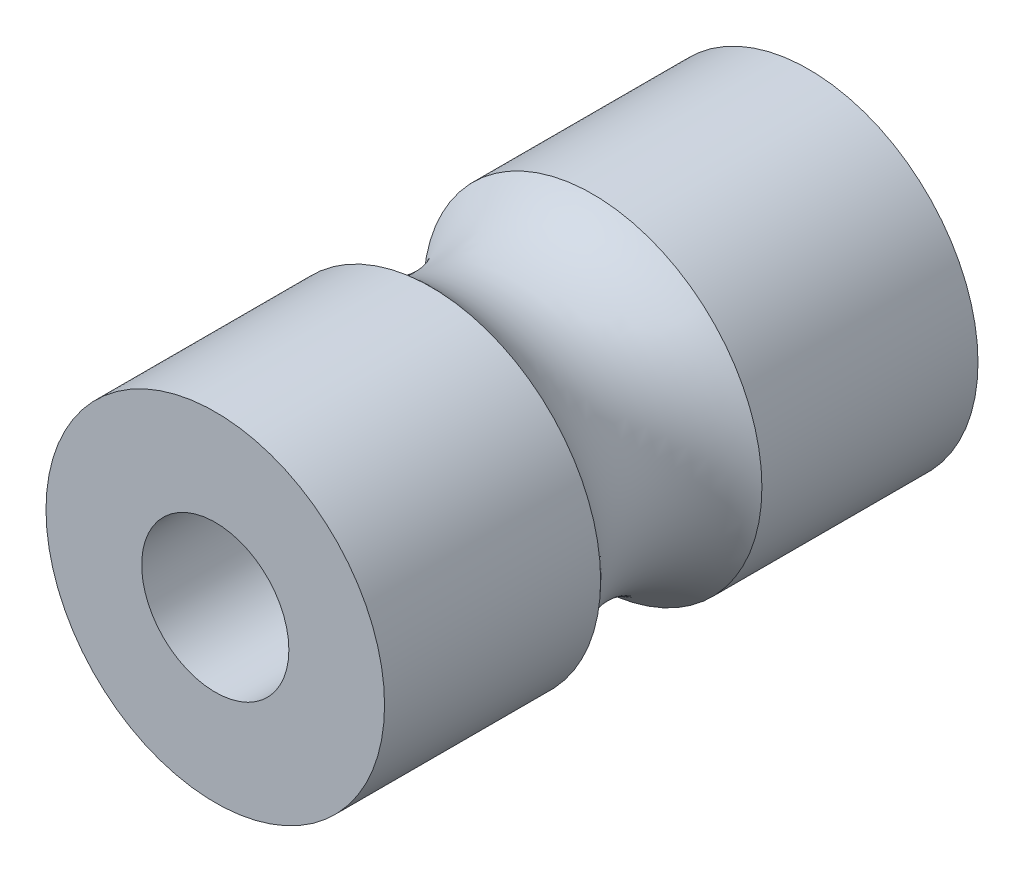
ISO-10303-21;
HEADER;
FILE_DESCRIPTION(('STEP AP214'),'2;1');
FILE_NAME('part.step','',(''),(''),'','','');
FILE_SCHEMA(('AUTOMOTIVE_DESIGN { 1 0 10303 214 1 1 1 1 }'));
ENDSEC;
DATA;
#1=APPLICATION_CONTEXT('core data for automotive mechanical design processes');
#2=APPLICATION_PROTOCOL_DEFINITION('international standard','automotive_design',2000,#1);
#3=PRODUCT_CONTEXT('',#1,'mechanical');
#4=PRODUCT('Part','Part','',(#3));
#5=PRODUCT_RELATED_PRODUCT_CATEGORY('part','',(#4));
#6=PRODUCT_DEFINITION_FORMATION('','',#4);
#7=PRODUCT_DEFINITION_CONTEXT('part definition',#1,'design');
#8=PRODUCT_DEFINITION('design','',#6,#7);
#9=PRODUCT_DEFINITION_SHAPE('','',#8);
#10=(LENGTH_UNIT() NAMED_UNIT(*) SI_UNIT(.MILLI.,.METRE.));
#11=(NAMED_UNIT(*) PLANE_ANGLE_UNIT() SI_UNIT($,.RADIAN.));
#12=(NAMED_UNIT(*) SI_UNIT($,.STERADIAN.) SOLID_ANGLE_UNIT());
#13=UNCERTAINTY_MEASURE_WITH_UNIT(LENGTH_MEASURE(1.E-05),#10,'distance_accuracy_value','');
#14=(GEOMETRIC_REPRESENTATION_CONTEXT(3) GLOBAL_UNCERTAINTY_ASSIGNED_CONTEXT((#13)) GLOBAL_UNIT_ASSIGNED_CONTEXT((#10,
#11,#12)) REPRESENTATION_CONTEXT('',''));
#15=CARTESIAN_POINT('',(0.,0.,0.));
#16=DIRECTION('',(0.,0.,1.));
#17=DIRECTION('',(1.,0.,0.));
#18=AXIS2_PLACEMENT_3D('',#15,#16,#17);
#19=CARTESIAN_POINT('',(0.,0.,-16.));
#20=DIRECTION('',(0.,0.,1.));
#21=DIRECTION('',(1.,0.,0.));
#22=AXIS2_PLACEMENT_3D('',#19,#20,#21);
#23=CYLINDRICAL_SURFACE('',#22,9.128125);
#24=CARTESIAN_POINT('',(0.,0.,16.));
#25=DIRECTION('',(0.,0.,1.));
#26=DIRECTION('',(1.,0.,0.));
#27=AXIS2_PLACEMENT_3D('',#24,#25,#26);
#28=CIRCLE('',#27,9.128125);
#29=CARTESIAN_POINT('',(9.128125,0.,16.));
#30=VERTEX_POINT('',#29);
#31=EDGE_CURVE('E45',#30,#30,#28,.T.);
#32=ORIENTED_EDGE('',*,*,#31,.F.);
#33=EDGE_LOOP('',(#32));
#34=FACE_BOUND('',#33,.T.);
#35=CARTESIAN_POINT('',(0.,0.,4.34821151272279));
#36=DIRECTION('',(0.,0.,-1.));
#37=DIRECTION('',(-1.,0.,0.));
#38=AXIS2_PLACEMENT_3D('',#35,#36,#37);
#39=CIRCLE('',#38,9.128125);
#40=CARTESIAN_POINT('',(-9.128125,0.,4.34821151272279));
#41=VERTEX_POINT('',#40);
#42=EDGE_CURVE('E50',#41,#41,#39,.F.);
#43=ORIENTED_EDGE('',*,*,#42,.T.);
#44=EDGE_LOOP('',(#43));
#45=FACE_BOUND('',#44,.T.);
#46=ADVANCED_FACE('F38',(#34,#45),#23,.T.);
#47=CARTESIAN_POINT('',(0.,0.,16.));
#48=DIRECTION('',(0.,0.,1.));
#49=DIRECTION('',(1.,0.,0.));
#50=AXIS2_PLACEMENT_3D('',#47,#48,#49);
#51=PLANE('',#50);
#52=CARTESIAN_POINT('',(0.,0.,16.));
#53=DIRECTION('',(0.,0.,1.));
#54=DIRECTION('',(1.,0.,0.));
#55=AXIS2_PLACEMENT_3D('',#52,#53,#54);
#56=CIRCLE('',#55,3.96874999999999);
#57=CARTESIAN_POINT('',(3.96874999999999,0.,16.));
#58=VERTEX_POINT('',#57);
#59=EDGE_CURVE('E114',#58,#58,#56,.T.);
#60=ORIENTED_EDGE('',*,*,#59,.F.);
#61=EDGE_LOOP('',(#60));
#62=FACE_BOUND('',#61,.T.);
#63=ORIENTED_EDGE('',*,*,#31,.T.);
#64=EDGE_LOOP('',(#63));
#65=FACE_BOUND('',#64,.T.);
#66=ADVANCED_FACE('F65',(#62,#65),#51,.T.);
#67=CARTESIAN_POINT('',(0.,0.,0.));
#68=DIRECTION('',(0.,0.,1.));
#69=DIRECTION('',(1.,0.,0.));
#70=AXIS2_PLACEMENT_3D('',#67,#68,#69);
#71=TOROIDAL_SURFACE('',#70,13.2625,6.);
#72=ORIENTED_EDGE('',*,*,#42,.F.);
#73=EDGE_LOOP('',(#72));
#74=FACE_BOUND('',#73,.T.);
#75=CARTESIAN_POINT('',(0.,0.,-4.34821151272279));
#76=DIRECTION('',(0.,0.,1.));
#77=DIRECTION('',(1.,0.,0.));
#78=AXIS2_PLACEMENT_3D('',#75,#76,#77);
#79=CIRCLE('',#78,9.128125);
#80=CARTESIAN_POINT('',(9.128125,0.,-4.34821151272279));
#81=VERTEX_POINT('',#80);
#82=EDGE_CURVE('E54',#81,#81,#79,.F.);
#83=ORIENTED_EDGE('',*,*,#82,.F.);
#84=EDGE_LOOP('',(#83));
#85=FACE_BOUND('',#84,.T.);
#86=ADVANCED_FACE('F61',(#74,#85),#71,.F.);
#87=CARTESIAN_POINT('',(0.,0.,-16.));
#88=DIRECTION('',(0.,0.,1.));
#89=DIRECTION('',(1.,0.,0.));
#90=AXIS2_PLACEMENT_3D('',#87,#88,#89);
#91=PLANE('',#90);
#92=CARTESIAN_POINT('',(0.,0.,-16.));
#93=DIRECTION('',(0.,0.,-1.));
#94=DIRECTION('',(-1.,0.,0.));
#95=AXIS2_PLACEMENT_3D('',#92,#93,#94);
#96=CIRCLE('',#95,3.96874999999999);
#97=CARTESIAN_POINT('',(-3.96874999999999,0.,-16.));
#98=VERTEX_POINT('',#97);
#99=EDGE_CURVE('E110',#98,#98,#96,.T.);
#100=ORIENTED_EDGE('',*,*,#99,.F.);
#101=EDGE_LOOP('',(#100));
#102=FACE_BOUND('',#101,.T.);
#103=CARTESIAN_POINT('',(0.,0.,-16.));
#104=DIRECTION('',(0.,0.,1.));
#105=DIRECTION('',(1.,0.,0.));
#106=AXIS2_PLACEMENT_3D('',#103,#104,#105);
#107=CIRCLE('',#106,9.128125);
#108=CARTESIAN_POINT('',(9.128125,0.,-16.));
#109=VERTEX_POINT('',#108);
#110=EDGE_CURVE('E10',#109,#109,#107,.T.);
#111=ORIENTED_EDGE('',*,*,#110,.F.);
#112=EDGE_LOOP('',(#111));
#113=FACE_BOUND('',#112,.T.);
#114=ADVANCED_FACE('F64',(#102,#113),#91,.F.);
#115=ORIENTED_EDGE('',*,*,#110,.T.);
#116=EDGE_LOOP('',(#115));
#117=FACE_BOUND('',#116,.T.);
#118=ORIENTED_EDGE('',*,*,#82,.T.);
#119=EDGE_LOOP('',(#118));
#120=FACE_BOUND('',#119,.T.);
#121=ADVANCED_FACE('F69',(#117,#120),#23,.T.);
#122=CARTESIAN_POINT('',(0.,0.,1.238));
#123=DIRECTION('',(0.,0.,1.));
#124=DIRECTION('',(1.,0.,0.));
#125=AXIS2_PLACEMENT_3D('',#122,#123,#124);
#126=CONICAL_SURFACE('',#125,3.96875,1.02974425867665);
#127=CARTESIAN_POINT('',(0.,0.,0.));
#128=DIRECTION('',(0.,0.,-1.));
#129=DIRECTION('',(-1.,0.,0.));
#130=AXIS2_PLACEMENT_3D('',#127,#128,#129);
#131=CIRCLE('',#130,1.90837200085006);
#132=CARTESIAN_POINT('',(-1.90837200085006,0.,0.));
#133=VERTEX_POINT('',#132);
#134=EDGE_CURVE('E41',#133,#133,#131,.T.);
#135=ORIENTED_EDGE('',*,*,#134,.T.);
#136=EDGE_LOOP('',(#135));
#137=FACE_BOUND('',#136,.T.);
#138=CARTESIAN_POINT('',(0.,0.,1.238));
#139=DIRECTION('',(0.,0.,1.));
#140=DIRECTION('',(1.,0.,0.));
#141=AXIS2_PLACEMENT_3D('',#138,#139,#140);
#142=CIRCLE('',#141,3.96875);
#143=CARTESIAN_POINT('',(3.96875,0.,1.238));
#144=VERTEX_POINT('',#143);
#145=EDGE_CURVE('E56',#144,#144,#142,.T.);
#146=ORIENTED_EDGE('',*,*,#145,.T.);
#147=EDGE_LOOP('',(#146));
#148=FACE_BOUND('',#147,.T.);
#149=ADVANCED_FACE('F71',(#137,#148),#126,.F.);
#150=CARTESIAN_POINT('',(0.,0.,16.));
#151=DIRECTION('',(0.,0.,1.));
#152=DIRECTION('',(1.,0.,0.));
#153=AXIS2_PLACEMENT_3D('',#150,#151,#152);
#154=CYLINDRICAL_SURFACE('',#153,3.96874999999999);
#155=ORIENTED_EDGE('',*,*,#145,.F.);
#156=EDGE_LOOP('',(#155));
#157=FACE_BOUND('',#156,.T.);
#158=ORIENTED_EDGE('',*,*,#59,.T.);
#159=EDGE_LOOP('',(#158));
#160=FACE_BOUND('',#159,.T.);
#161=ADVANCED_FACE('F76',(#157,#160),#154,.F.);
#162=CARTESIAN_POINT('',(0.,0.,-1.238));
#163=DIRECTION('',(0.,0.,-1.));
#164=DIRECTION('',(-1.,0.,0.));
#165=AXIS2_PLACEMENT_3D('',#162,#163,#164);
#166=CONICAL_SURFACE('',#165,3.96875,1.02974425867665);
#167=CARTESIAN_POINT('',(0.,0.,-1.238));
#168=DIRECTION('',(0.,0.,-1.));
#169=DIRECTION('',(-1.,0.,0.));
#170=AXIS2_PLACEMENT_3D('',#167,#168,#169);
#171=CIRCLE('',#170,3.96875);
#172=CARTESIAN_POINT('',(-3.96875,0.,-1.238));
#173=VERTEX_POINT('',#172);
#174=EDGE_CURVE('E107',#173,#173,#171,.T.);
#175=ORIENTED_EDGE('',*,*,#174,.T.);
#176=EDGE_LOOP('',(#175));
#177=FACE_BOUND('',#176,.T.);
#178=ORIENTED_EDGE('',*,*,#134,.F.);
#179=EDGE_LOOP('',(#178));
#180=FACE_BOUND('',#179,.T.);
#181=ADVANCED_FACE('F94',(#177,#180),#166,.F.);
#182=CARTESIAN_POINT('',(0.,0.,-16.));
#183=DIRECTION('',(0.,0.,-1.));
#184=DIRECTION('',(-1.,0.,0.));
#185=AXIS2_PLACEMENT_3D('',#182,#183,#184);
#186=CYLINDRICAL_SURFACE('',#185,3.96874999999999);
#187=ORIENTED_EDGE('',*,*,#174,.F.);
#188=EDGE_LOOP('',(#187));
#189=FACE_BOUND('',#188,.T.);
#190=ORIENTED_EDGE('',*,*,#99,.T.);
#191=EDGE_LOOP('',(#190));
#192=FACE_BOUND('',#191,.T.);
#193=ADVANCED_FACE('F98',(#189,#192),#186,.F.);
#194=CLOSED_SHELL('',(#46,#66,#86,#114,#121,#149,#161,#181,#193));
#195=MANIFOLD_SOLID_BREP('B2',#194);
#196=ADVANCED_BREP_SHAPE_REPRESENTATION('',(#18,#195),#14);
#197=SHAPE_DEFINITION_REPRESENTATION(#9,#196);
ENDSEC;
END-ISO-10303-21;
